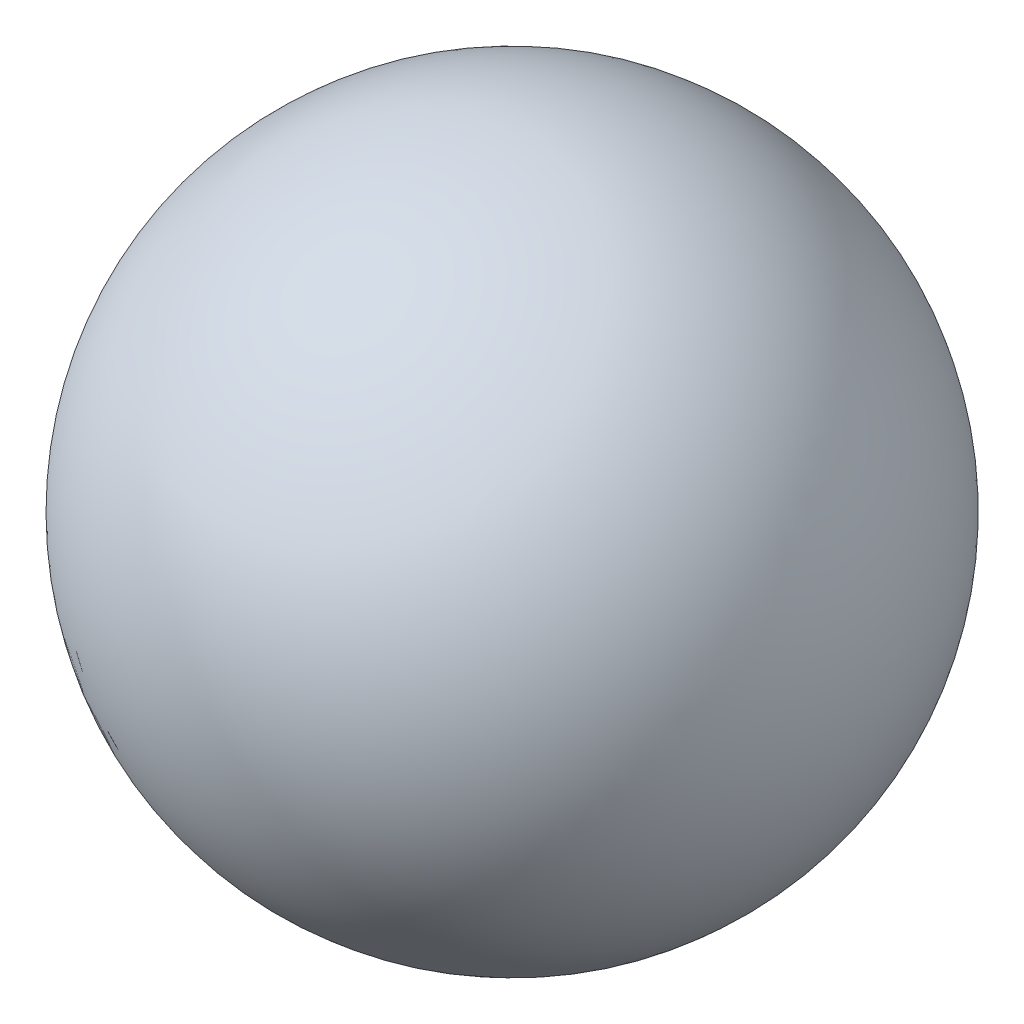
ISO-10303-21;
HEADER;
FILE_DESCRIPTION(('STEP AP214'),'2;1');
FILE_NAME('part.step','',(''),(''),'','','');
FILE_SCHEMA(('AUTOMOTIVE_DESIGN { 1 0 10303 214 1 1 1 1 }'));
ENDSEC;
DATA;
#1=APPLICATION_CONTEXT('core data for automotive mechanical design processes');
#2=APPLICATION_PROTOCOL_DEFINITION('international standard','automotive_design',2000,#1);
#3=PRODUCT_CONTEXT('',#1,'mechanical');
#4=PRODUCT('Part','Part','',(#3));
#5=PRODUCT_RELATED_PRODUCT_CATEGORY('part','',(#4));
#6=PRODUCT_DEFINITION_FORMATION('','',#4);
#7=PRODUCT_DEFINITION_CONTEXT('part definition',#1,'design');
#8=PRODUCT_DEFINITION('design','',#6,#7);
#9=PRODUCT_DEFINITION_SHAPE('','',#8);
#10=(LENGTH_UNIT() NAMED_UNIT(*) SI_UNIT(.MILLI.,.METRE.));
#11=(NAMED_UNIT(*) PLANE_ANGLE_UNIT() SI_UNIT($,.RADIAN.));
#12=(NAMED_UNIT(*) SI_UNIT($,.STERADIAN.) SOLID_ANGLE_UNIT());
#13=UNCERTAINTY_MEASURE_WITH_UNIT(LENGTH_MEASURE(1.E-05),#10,'distance_accuracy_value','');
#14=(GEOMETRIC_REPRESENTATION_CONTEXT(3) GLOBAL_UNCERTAINTY_ASSIGNED_CONTEXT((#13)) GLOBAL_UNIT_ASSIGNED_CONTEXT((#10,
#11,#12)) REPRESENTATION_CONTEXT('',''));
#15=CARTESIAN_POINT('',(0.,0.,0.));
#16=DIRECTION('',(0.,0.,1.));
#17=DIRECTION('',(1.,0.,0.));
#18=AXIS2_PLACEMENT_3D('',#15,#16,#17);
#19=CARTESIAN_POINT('',(0.,0.,0.));
#20=DIRECTION('',(0.726439659113234,0.504127804833152,0.467055219499317));
#21=DIRECTION('',(-0.393290616159059,-0.252361587038962,0.884101872313595));
#22=AXIS2_PLACEMENT_3D('',#19,#20,#21);
#23=SPHERICAL_SURFACE('',#22,0.794);
#24=CARTESIAN_POINT('',(-0.576793089335908,-0.400277477037523,-0.370841844282458));
#25=VERTEX_POINT('',#24);
#26=VERTEX_LOOP('',#25);
#27=FACE_BOUND('',#26,.T.);
#28=CARTESIAN_POINT('',(0.576793089335908,0.400277477037523,0.370841844282457));
#29=VERTEX_POINT('',#28);
#30=VERTEX_LOOP('',#29);
#31=FACE_BOUND('',#30,.T.);
#32=ADVANCED_FACE('F15',(#27,#31),#23,.T.);
#33=CLOSED_SHELL('',(#32));
#34=MANIFOLD_SOLID_BREP('B1',#33);
#35=ADVANCED_BREP_SHAPE_REPRESENTATION('',(#18,#34),#14);
#36=SHAPE_DEFINITION_REPRESENTATION(#9,#35);
ENDSEC;
END-ISO-10303-21;
